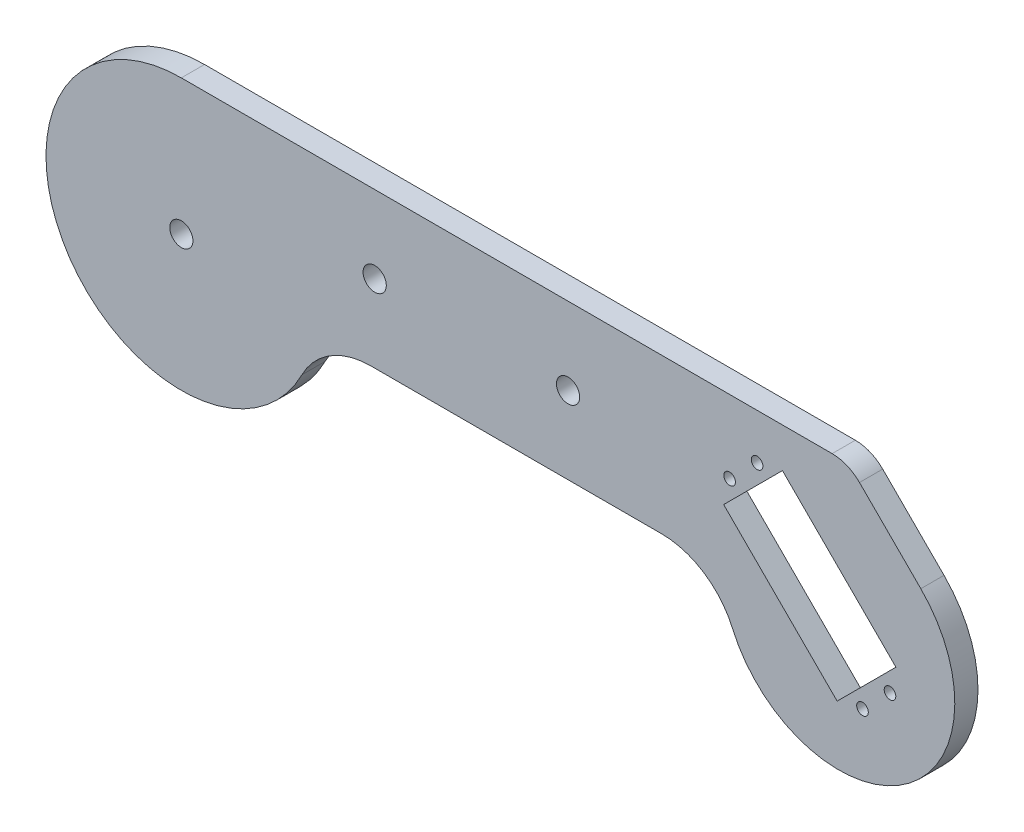
ISO-10303-21;
HEADER;
FILE_DESCRIPTION(('STEP AP214'),'2;1');
FILE_NAME('part.step','',(''),(''),'','','');
FILE_SCHEMA(('AUTOMOTIVE_DESIGN { 1 0 10303 214 1 1 1 1 }'));
ENDSEC;
DATA;
#1=APPLICATION_CONTEXT('core data for automotive mechanical design processes');
#2=APPLICATION_PROTOCOL_DEFINITION('international standard','automotive_design',2000,#1);
#3=PRODUCT_CONTEXT('',#1,'mechanical');
#4=PRODUCT('Part','Part','',(#3));
#5=PRODUCT_RELATED_PRODUCT_CATEGORY('part','',(#4));
#6=PRODUCT_DEFINITION_FORMATION('','',#4);
#7=PRODUCT_DEFINITION_CONTEXT('part definition',#1,'design');
#8=PRODUCT_DEFINITION('design','',#6,#7);
#9=PRODUCT_DEFINITION_SHAPE('','',#8);
#10=(LENGTH_UNIT() NAMED_UNIT(*) SI_UNIT(.MILLI.,.METRE.));
#11=(NAMED_UNIT(*) PLANE_ANGLE_UNIT() SI_UNIT($,.RADIAN.));
#12=(NAMED_UNIT(*) SI_UNIT($,.STERADIAN.) SOLID_ANGLE_UNIT());
#13=UNCERTAINTY_MEASURE_WITH_UNIT(LENGTH_MEASURE(1.E-05),#10,'distance_accuracy_value','');
#14=(GEOMETRIC_REPRESENTATION_CONTEXT(3) GLOBAL_UNCERTAINTY_ASSIGNED_CONTEXT((#13)) GLOBAL_UNIT_ASSIGNED_CONTEXT((#10,
#11,#12)) REPRESENTATION_CONTEXT('',''));
#15=CARTESIAN_POINT('',(0.,0.,0.));
#16=DIRECTION('',(0.,0.,1.));
#17=DIRECTION('',(1.,0.,0.));
#18=AXIS2_PLACEMENT_3D('',#15,#16,#17);
#19=CARTESIAN_POINT('',(170.,-5.,6.));
#20=DIRECTION('',(0.,0.,1.));
#21=DIRECTION('',(1.,0.,0.));
#22=AXIS2_PLACEMENT_3D('',#19,#20,#21);
#23=PLANE('',#22);
#24=CARTESIAN_POINT('',(148.875627927253,23.2307952236721,6.));
#25=DIRECTION('',(0.,0.,1.));
#26=DIRECTION('',(1.,0.,0.));
#27=AXIS2_PLACEMENT_3D('',#24,#25,#26);
#28=CIRCLE('',#27,1.5);
#29=CARTESIAN_POINT('',(150.375627927253,23.2307952236721,6.));
#30=VERTEX_POINT('',#29);
#31=EDGE_CURVE('E368',#30,#30,#28,.T.);
#32=ORIENTED_EDGE('',*,*,#31,.F.);
#33=EDGE_LOOP('',(#32));
#34=FACE_BOUND('',#33,.T.);
#35=CARTESIAN_POINT('',(183.241017492919,-11.134594341994,6.));
#36=DIRECTION('',(0.,0.,1.));
#37=DIRECTION('',(-1.,0.,0.));
#38=AXIS2_PLACEMENT_3D('',#35,#36,#37);
#39=CIRCLE('',#38,1.5);
#40=CARTESIAN_POINT('',(181.741017492919,-11.134594341994,6.));
#41=VERTEX_POINT('',#40);
#42=EDGE_CURVE('E157',#41,#41,#39,.T.);
#43=ORIENTED_EDGE('',*,*,#42,.F.);
#44=EDGE_LOOP('',(#43));
#45=FACE_BOUND('',#44,.T.);
#46=CARTESIAN_POINT('',(50.,15.,6.));
#47=DIRECTION('',(0.,0.,1.));
#48=DIRECTION('',(1.,0.,0.));
#49=AXIS2_PLACEMENT_3D('',#46,#47,#48);
#50=CIRCLE('',#49,3.00000000000001);
#51=CARTESIAN_POINT('',(53.,15.,6.));
#52=VERTEX_POINT('',#51);
#53=EDGE_CURVE('E173',#52,#52,#50,.T.);
#54=ORIENTED_EDGE('',*,*,#53,.F.);
#55=EDGE_LOOP('',(#54));
#56=FACE_BOUND('',#55,.T.);
#57=CARTESIAN_POINT('',(170.,-5.,6.));
#58=DIRECTION('',(0.,0.,1.));
#59=DIRECTION('',(1.,0.,0.));
#60=AXIS2_PLACEMENT_3D('',#57,#58,#59);
#61=CIRCLE('',#60,30.);
#62=CARTESIAN_POINT('',(142.504545830265,-17.,6.));
#63=VERTEX_POINT('',#62);
#64=CARTESIAN_POINT('',(191.213203435596,16.2132034355964,6.));
#65=VERTEX_POINT('',#64);
#66=EDGE_CURVE('E185',#63,#65,#61,.T.);
#67=ORIENTED_EDGE('',*,*,#66,.T.);
#68=DIRECTION('',(-0.707106781186547,0.707106781186548,0.));
#69=VECTOR('',#68,1.);
#70=CARTESIAN_POINT('',(175.355339059327,32.0710678118655,6.));
#71=LINE('',#70,#69);
#72=CARTESIAN_POINT('',(175.355339059327,32.0710678118655,6.));
#73=VERTEX_POINT('',#72);
#74=EDGE_CURVE('E188',#65,#73,#71,.T.);
#75=ORIENTED_EDGE('',*,*,#74,.T.);
#76=CARTESIAN_POINT('',(168.284271247462,25.,6.));
#77=DIRECTION('',(0.,0.,1.));
#78=DIRECTION('',(1.,0.,0.));
#79=AXIS2_PLACEMENT_3D('',#76,#77,#78);
#80=CIRCLE('',#79,10.);
#81=CARTESIAN_POINT('',(168.284271247462,35.,6.));
#82=VERTEX_POINT('',#81);
#83=EDGE_CURVE('E191',#73,#82,#80,.T.);
#84=ORIENTED_EDGE('',*,*,#83,.T.);
#85=DIRECTION('',(-1.,0.,0.));
#86=VECTOR('',#85,1.);
#87=CARTESIAN_POINT('',(0.,35.,6.));
#88=LINE('',#87,#86);
#89=CARTESIAN_POINT('',(0.,35.,6.));
#90=VERTEX_POINT('',#89);
#91=EDGE_CURVE('E193',#82,#90,#88,.T.);
#92=ORIENTED_EDGE('',*,*,#91,.T.);
#93=CARTESIAN_POINT('',(0.,0.,6.));
#94=DIRECTION('',(0.,0.,1.));
#95=DIRECTION('',(1.,0.,0.));
#96=AXIS2_PLACEMENT_3D('',#93,#94,#95);
#97=CIRCLE('',#96,35.);
#98=CARTESIAN_POINT('',(31.1753239990586,-15.9090909090909,6.));
#99=VERTEX_POINT('',#98);
#100=EDGE_CURVE('E195',#90,#99,#97,.T.);
#101=ORIENTED_EDGE('',*,*,#100,.T.);
#102=CARTESIAN_POINT('',(48.9897948556636,-25.,6.));
#103=DIRECTION('',(0.,0.,-1.));
#104=DIRECTION('',(1.,0.,0.));
#105=AXIS2_PLACEMENT_3D('',#102,#103,#104);
#106=CIRCLE('',#105,20.);
#107=CARTESIAN_POINT('',(48.9897948556636,-5.00000000000002,6.));
#108=VERTEX_POINT('',#107);
#109=EDGE_CURVE('E197',#99,#108,#106,.T.);
#110=ORIENTED_EDGE('',*,*,#109,.T.);
#111=DIRECTION('',(1.,0.,0.));
#112=VECTOR('',#111,1.);
#113=CARTESIAN_POINT('',(124.174243050441,-5.,6.));
#114=LINE('',#113,#112);
#115=CARTESIAN_POINT('',(124.174243050441,-5.,6.));
#116=VERTEX_POINT('',#115);
#117=EDGE_CURVE('E199',#108,#116,#114,.T.);
#118=ORIENTED_EDGE('',*,*,#117,.T.);
#119=CARTESIAN_POINT('',(124.174243050441,-25.,6.));
#120=DIRECTION('',(0.,0.,-1.));
#121=DIRECTION('',(-1.,0.,0.));
#122=AXIS2_PLACEMENT_3D('',#119,#120,#121);
#123=CIRCLE('',#122,20.);
#124=EDGE_CURVE('E201',#116,#63,#123,.T.);
#125=ORIENTED_EDGE('',*,*,#124,.T.);
#126=EDGE_LOOP('',(#67,#75,#84,#92,#101,#110,#118,#125));
#127=FACE_BOUND('',#126,.T.);
#128=CARTESIAN_POINT('',(0.,0.,6.));
#129=DIRECTION('',(0.,0.,1.));
#130=DIRECTION('',(1.,0.,0.));
#131=AXIS2_PLACEMENT_3D('',#128,#129,#130);
#132=CIRCLE('',#131,3.);
#133=CARTESIAN_POINT('',(3.,0.,6.));
#134=VERTEX_POINT('',#133);
#135=EDGE_CURVE('E179',#134,#134,#132,.T.);
#136=ORIENTED_EDGE('',*,*,#135,.F.);
#137=EDGE_LOOP('',(#136));
#138=FACE_BOUND('',#137,.T.);
#139=CARTESIAN_POINT('',(100.,15.,6.));
#140=DIRECTION('',(0.,0.,1.));
#141=DIRECTION('',(1.,0.,0.));
#142=AXIS2_PLACEMENT_3D('',#139,#140,#141);
#143=CIRCLE('',#142,2.99999999999999);
#144=CARTESIAN_POINT('',(103.,15.,6.));
#145=VERTEX_POINT('',#144);
#146=EDGE_CURVE('E167',#145,#145,#143,.T.);
#147=ORIENTED_EDGE('',*,*,#146,.F.);
#148=EDGE_LOOP('',(#147));
#149=FACE_BOUND('',#148,.T.);
#150=DIRECTION('',(-0.707106781186547,0.707106781186548,0.));
#151=VECTOR('',#150,1.);
#152=CARTESIAN_POINT('',(155.434043322758,24.768752472753,6.));
#153=LINE('',#152,#151);
#154=CARTESIAN_POINT('',(184.778974742,-4.57617894648877,6.));
#155=VERTEX_POINT('',#154);
#156=CARTESIAN_POINT('',(155.434043322758,24.768752472753,6.));
#157=VERTEX_POINT('',#156);
#158=EDGE_CURVE('E136',#155,#157,#153,.T.);
#159=ORIENTED_EDGE('',*,*,#158,.F.);
#160=DIRECTION('',(0.707106781186548,0.707106781186547,0.));
#161=VECTOR('',#160,1.);
#162=CARTESIAN_POINT('',(184.778974742,-4.57617894648877,6.));
#163=LINE('',#162,#161);
#164=CARTESIAN_POINT('',(169.576178946489,-19.7789747419995,6.));
#165=VERTEX_POINT('',#164);
#166=EDGE_CURVE('E128',#165,#155,#163,.T.);
#167=ORIENTED_EDGE('',*,*,#166,.F.);
#168=DIRECTION('',(0.707106781186548,-0.707106781186548,0.));
#169=VECTOR('',#168,1.);
#170=CARTESIAN_POINT('',(140.231247527247,9.56595667724219,6.));
#171=LINE('',#170,#169);
#172=CARTESIAN_POINT('',(140.231247527247,9.56595667724219,6.));
#173=VERTEX_POINT('',#172);
#174=EDGE_CURVE('E151',#173,#165,#171,.T.);
#175=ORIENTED_EDGE('',*,*,#174,.F.);
#176=DIRECTION('',(-0.707106781186547,-0.707106781186548,0.));
#177=VECTOR('',#176,1.);
#178=CARTESIAN_POINT('',(155.434043322758,24.768752472753,6.));
#179=LINE('',#178,#177);
#180=EDGE_CURVE('E149',#157,#173,#179,.T.);
#181=ORIENTED_EDGE('',*,*,#180,.F.);
#182=EDGE_LOOP('',(#159,#167,#175,#181));
#183=FACE_BOUND('',#182,.T.);
#184=CARTESIAN_POINT('',(141.769204776328,16.1243720727474,6.));
#185=DIRECTION('',(0.,0.,1.));
#186=DIRECTION('',(1.,0.,0.));
#187=AXIS2_PLACEMENT_3D('',#184,#185,#186);
#188=CIRCLE('',#187,1.5);
#189=CARTESIAN_POINT('',(143.269204776328,16.1243720727474,6.));
#190=VERTEX_POINT('',#189);
#191=EDGE_CURVE('E374',#190,#190,#188,.T.);
#192=ORIENTED_EDGE('',*,*,#191,.F.);
#193=EDGE_LOOP('',(#192));
#194=FACE_BOUND('',#193,.T.);
#195=CARTESIAN_POINT('',(176.134594341994,-18.2410174929189,6.));
#196=DIRECTION('',(0.,0.,1.));
#197=DIRECTION('',(-1.,0.,0.));
#198=AXIS2_PLACEMENT_3D('',#195,#196,#197);
#199=CIRCLE('',#198,1.5);
#200=CARTESIAN_POINT('',(174.634594341994,-18.2410174929189,6.));
#201=VERTEX_POINT('',#200);
#202=EDGE_CURVE('E359',#201,#201,#199,.T.);
#203=ORIENTED_EDGE('',*,*,#202,.F.);
#204=EDGE_LOOP('',(#203));
#205=FACE_BOUND('',#204,.T.);
#206=ADVANCED_FACE('F39',(#34,#45,#56,#127,#138,#149,#183,#194,#205),#23,.T.);
#207=CARTESIAN_POINT('',(170.,-5.,0.));
#208=DIRECTION('',(0.,0.,1.));
#209=DIRECTION('',(1.,0.,0.));
#210=AXIS2_PLACEMENT_3D('',#207,#208,#209);
#211=PLANE('',#210);
#212=CARTESIAN_POINT('',(100.,15.,0.));
#213=DIRECTION('',(0.,0.,1.));
#214=DIRECTION('',(1.,0.,0.));
#215=AXIS2_PLACEMENT_3D('',#212,#213,#214);
#216=CIRCLE('',#215,2.99999999999999);
#217=CARTESIAN_POINT('',(103.,15.,0.));
#218=VERTEX_POINT('',#217);
#219=EDGE_CURVE('E144',#218,#218,#216,.T.);
#220=ORIENTED_EDGE('',*,*,#219,.T.);
#221=EDGE_LOOP('',(#220));
#222=FACE_BOUND('',#221,.T.);
#223=CARTESIAN_POINT('',(50.,15.,0.));
#224=DIRECTION('',(0.,0.,1.));
#225=DIRECTION('',(1.,0.,0.));
#226=AXIS2_PLACEMENT_3D('',#223,#224,#225);
#227=CIRCLE('',#226,3.00000000000001);
#228=CARTESIAN_POINT('',(53.,15.,0.));
#229=VERTEX_POINT('',#228);
#230=EDGE_CURVE('E170',#229,#229,#227,.T.);
#231=ORIENTED_EDGE('',*,*,#230,.T.);
#232=EDGE_LOOP('',(#231));
#233=FACE_BOUND('',#232,.T.);
#234=CARTESIAN_POINT('',(0.,0.,0.));
#235=DIRECTION('',(0.,0.,1.));
#236=DIRECTION('',(1.,0.,0.));
#237=AXIS2_PLACEMENT_3D('',#234,#235,#236);
#238=CIRCLE('',#237,3.);
#239=CARTESIAN_POINT('',(3.,0.,0.));
#240=VERTEX_POINT('',#239);
#241=EDGE_CURVE('E176',#240,#240,#238,.T.);
#242=ORIENTED_EDGE('',*,*,#241,.T.);
#243=EDGE_LOOP('',(#242));
#244=FACE_BOUND('',#243,.T.);
#245=CARTESIAN_POINT('',(170.,-5.,0.));
#246=DIRECTION('',(0.,0.,1.));
#247=DIRECTION('',(1.,0.,0.));
#248=AXIS2_PLACEMENT_3D('',#245,#246,#247);
#249=CIRCLE('',#248,30.);
#250=CARTESIAN_POINT('',(142.504545830265,-17.,0.));
#251=VERTEX_POINT('',#250);
#252=CARTESIAN_POINT('',(191.213203435596,16.2132034355964,0.));
#253=VERTEX_POINT('',#252);
#254=EDGE_CURVE('E182',#251,#253,#249,.T.);
#255=ORIENTED_EDGE('',*,*,#254,.F.);
#256=CARTESIAN_POINT('',(124.174243050441,-25.,0.));
#257=DIRECTION('',(0.,0.,-1.));
#258=DIRECTION('',(-1.,0.,0.));
#259=AXIS2_PLACEMENT_3D('',#256,#257,#258);
#260=CIRCLE('',#259,20.);
#261=CARTESIAN_POINT('',(124.174243050441,-5.,0.));
#262=VERTEX_POINT('',#261);
#263=EDGE_CURVE('E189',#262,#251,#260,.T.);
#264=ORIENTED_EDGE('',*,*,#263,.F.);
#265=DIRECTION('',(1.,0.,0.));
#266=VECTOR('',#265,1.);
#267=CARTESIAN_POINT('',(124.174243050441,-5.,0.));
#268=LINE('',#267,#266);
#269=CARTESIAN_POINT('',(48.9897948556636,-5.00000000000002,0.));
#270=VERTEX_POINT('',#269);
#271=EDGE_CURVE('E216',#270,#262,#268,.T.);
#272=ORIENTED_EDGE('',*,*,#271,.F.);
#273=CARTESIAN_POINT('',(48.9897948556636,-25.,0.));
#274=DIRECTION('',(0.,0.,-1.));
#275=DIRECTION('',(1.,0.,0.));
#276=AXIS2_PLACEMENT_3D('',#273,#274,#275);
#277=CIRCLE('',#276,20.);
#278=CARTESIAN_POINT('',(31.1753239990586,-15.9090909090909,0.));
#279=VERTEX_POINT('',#278);
#280=EDGE_CURVE('E214',#279,#270,#277,.T.);
#281=ORIENTED_EDGE('',*,*,#280,.F.);
#282=CARTESIAN_POINT('',(0.,0.,0.));
#283=DIRECTION('',(0.,0.,1.));
#284=DIRECTION('',(1.,0.,0.));
#285=AXIS2_PLACEMENT_3D('',#282,#283,#284);
#286=CIRCLE('',#285,35.);
#287=CARTESIAN_POINT('',(0.,35.,0.));
#288=VERTEX_POINT('',#287);
#289=EDGE_CURVE('E212',#288,#279,#286,.T.);
#290=ORIENTED_EDGE('',*,*,#289,.F.);
#291=DIRECTION('',(-1.,0.,0.));
#292=VECTOR('',#291,1.);
#293=CARTESIAN_POINT('',(0.,35.,0.));
#294=LINE('',#293,#292);
#295=CARTESIAN_POINT('',(168.284271247462,35.,0.));
#296=VERTEX_POINT('',#295);
#297=EDGE_CURVE('E210',#296,#288,#294,.T.);
#298=ORIENTED_EDGE('',*,*,#297,.F.);
#299=CARTESIAN_POINT('',(168.284271247462,25.,0.));
#300=DIRECTION('',(0.,0.,1.));
#301=DIRECTION('',(1.,0.,0.));
#302=AXIS2_PLACEMENT_3D('',#299,#300,#301);
#303=CIRCLE('',#302,10.);
#304=CARTESIAN_POINT('',(175.355339059327,32.0710678118655,0.));
#305=VERTEX_POINT('',#304);
#306=EDGE_CURVE('E208',#305,#296,#303,.T.);
#307=ORIENTED_EDGE('',*,*,#306,.F.);
#308=DIRECTION('',(-0.707106781186547,0.707106781186548,0.));
#309=VECTOR('',#308,1.);
#310=CARTESIAN_POINT('',(175.355339059327,32.0710678118655,0.));
#311=LINE('',#310,#309);
#312=EDGE_CURVE('E206',#253,#305,#311,.T.);
#313=ORIENTED_EDGE('',*,*,#312,.F.);
#314=EDGE_LOOP('',(#255,#264,#272,#281,#290,#298,#307,#313));
#315=FACE_BOUND('',#314,.T.);
#316=DIRECTION('',(0.707106781186548,0.707106781186547,0.));
#317=VECTOR('',#316,1.);
#318=CARTESIAN_POINT('',(184.778974742,-4.57617894648877,0.));
#319=LINE('',#318,#317);
#320=CARTESIAN_POINT('',(169.576178946489,-19.7789747419995,0.));
#321=VERTEX_POINT('',#320);
#322=CARTESIAN_POINT('',(184.778974742,-4.57617894648877,0.));
#323=VERTEX_POINT('',#322);
#324=EDGE_CURVE('E62',#321,#323,#319,.T.);
#325=ORIENTED_EDGE('',*,*,#324,.T.);
#326=DIRECTION('',(-0.707106781186547,0.707106781186548,0.));
#327=VECTOR('',#326,1.);
#328=CARTESIAN_POINT('',(155.434043322758,24.768752472753,0.));
#329=LINE('',#328,#327);
#330=CARTESIAN_POINT('',(155.434043322758,24.768752472753,0.));
#331=VERTEX_POINT('',#330);
#332=EDGE_CURVE('E143',#323,#331,#329,.T.);
#333=ORIENTED_EDGE('',*,*,#332,.T.);
#334=DIRECTION('',(-0.707106781186547,-0.707106781186548,0.));
#335=VECTOR('',#334,1.);
#336=CARTESIAN_POINT('',(155.434043322758,24.768752472753,0.));
#337=LINE('',#336,#335);
#338=CARTESIAN_POINT('',(140.231247527247,9.56595667724219,0.));
#339=VERTEX_POINT('',#338);
#340=EDGE_CURVE('E159',#331,#339,#337,.T.);
#341=ORIENTED_EDGE('',*,*,#340,.T.);
#342=DIRECTION('',(0.707106781186548,-0.707106781186548,0.));
#343=VECTOR('',#342,1.);
#344=CARTESIAN_POINT('',(140.231247527247,9.56595667724219,0.));
#345=LINE('',#344,#343);
#346=EDGE_CURVE('E137',#339,#321,#345,.T.);
#347=ORIENTED_EDGE('',*,*,#346,.T.);
#348=EDGE_LOOP('',(#325,#333,#341,#347));
#349=FACE_BOUND('',#348,.T.);
#350=CARTESIAN_POINT('',(183.241017492919,-11.134594341994,0.));
#351=DIRECTION('',(0.,0.,1.));
#352=DIRECTION('',(-1.,0.,0.));
#353=AXIS2_PLACEMENT_3D('',#350,#351,#352);
#354=CIRCLE('',#353,1.5);
#355=CARTESIAN_POINT('',(181.741017492919,-11.134594341994,0.));
#356=VERTEX_POINT('',#355);
#357=EDGE_CURVE('E377',#356,#356,#354,.T.);
#358=ORIENTED_EDGE('',*,*,#357,.T.);
#359=EDGE_LOOP('',(#358));
#360=FACE_BOUND('',#359,.T.);
#361=CARTESIAN_POINT('',(141.769204776328,16.1243720727474,0.));
#362=DIRECTION('',(0.,0.,1.));
#363=DIRECTION('',(1.,0.,0.));
#364=AXIS2_PLACEMENT_3D('',#361,#362,#363);
#365=CIRCLE('',#364,1.5);
#366=CARTESIAN_POINT('',(143.269204776328,16.1243720727474,0.));
#367=VERTEX_POINT('',#366);
#368=EDGE_CURVE('E371',#367,#367,#365,.T.);
#369=ORIENTED_EDGE('',*,*,#368,.T.);
#370=EDGE_LOOP('',(#369));
#371=FACE_BOUND('',#370,.T.);
#372=CARTESIAN_POINT('',(148.875627927253,23.2307952236721,0.));
#373=DIRECTION('',(0.,0.,1.));
#374=DIRECTION('',(1.,0.,0.));
#375=AXIS2_PLACEMENT_3D('',#372,#373,#374);
#376=CIRCLE('',#375,1.5);
#377=CARTESIAN_POINT('',(150.375627927253,23.2307952236721,0.));
#378=VERTEX_POINT('',#377);
#379=EDGE_CURVE('E365',#378,#378,#376,.T.);
#380=ORIENTED_EDGE('',*,*,#379,.T.);
#381=EDGE_LOOP('',(#380));
#382=FACE_BOUND('',#381,.T.);
#383=CARTESIAN_POINT('',(176.134594341994,-18.2410174929189,0.));
#384=DIRECTION('',(0.,0.,1.));
#385=DIRECTION('',(-1.,0.,0.));
#386=AXIS2_PLACEMENT_3D('',#383,#384,#385);
#387=CIRCLE('',#386,1.5);
#388=CARTESIAN_POINT('',(174.634594341994,-18.2410174929189,0.));
#389=VERTEX_POINT('',#388);
#390=EDGE_CURVE('E362',#389,#389,#387,.T.);
#391=ORIENTED_EDGE('',*,*,#390,.T.);
#392=EDGE_LOOP('',(#391));
#393=FACE_BOUND('',#392,.T.);
#394=ADVANCED_FACE('F246',(#222,#233,#244,#315,#349,#360,#371,#382,#393),#211,.F.);
#395=CARTESIAN_POINT('',(170.,-5.,6.));
#396=DIRECTION('',(0.,0.,-1.));
#397=DIRECTION('',(-1.,0.,0.));
#398=AXIS2_PLACEMENT_3D('',#395,#396,#397);
#399=CYLINDRICAL_SURFACE('',#398,30.);
#400=ORIENTED_EDGE('',*,*,#254,.T.);
#401=DIRECTION('',(0.,0.,-1.));
#402=VECTOR('',#401,1.);
#403=CARTESIAN_POINT('',(191.213203435596,16.2132034355964,6.));
#404=LINE('',#403,#402);
#405=EDGE_CURVE('E11',#65,#253,#404,.T.);
#406=ORIENTED_EDGE('',*,*,#405,.F.);
#407=ORIENTED_EDGE('',*,*,#66,.F.);
#408=DIRECTION('',(0.,0.,-1.));
#409=VECTOR('',#408,1.);
#410=CARTESIAN_POINT('',(142.504545830265,-17.,6.));
#411=LINE('',#410,#409);
#412=EDGE_CURVE('E203',#63,#251,#411,.T.);
#413=ORIENTED_EDGE('',*,*,#412,.T.);
#414=EDGE_LOOP('',(#400,#406,#407,#413));
#415=FACE_BOUND('',#414,.T.);
#416=ADVANCED_FACE('F41',(#415),#399,.T.);
#417=CARTESIAN_POINT('',(175.355339059327,32.0710678118655,6.));
#418=DIRECTION('',(-0.707106781186548,-0.707106781186547,0.));
#419=DIRECTION('',(0.707106781186547,-0.707106781186548,0.));
#420=AXIS2_PLACEMENT_3D('',#417,#418,#419);
#421=PLANE('',#420);
#422=ORIENTED_EDGE('',*,*,#312,.T.);
#423=DIRECTION('',(0.,0.,-1.));
#424=VECTOR('',#423,1.);
#425=CARTESIAN_POINT('',(175.355339059327,32.0710678118655,6.));
#426=LINE('',#425,#424);
#427=EDGE_CURVE('E47',#73,#305,#426,.T.);
#428=ORIENTED_EDGE('',*,*,#427,.F.);
#429=ORIENTED_EDGE('',*,*,#74,.F.);
#430=ORIENTED_EDGE('',*,*,#405,.T.);
#431=EDGE_LOOP('',(#422,#428,#429,#430));
#432=FACE_BOUND('',#431,.T.);
#433=ADVANCED_FACE('F264',(#432),#421,.F.);
#434=CARTESIAN_POINT('',(168.284271247462,25.,6.));
#435=DIRECTION('',(0.,0.,-1.));
#436=DIRECTION('',(-1.,0.,0.));
#437=AXIS2_PLACEMENT_3D('',#434,#435,#436);
#438=CYLINDRICAL_SURFACE('',#437,10.);
#439=ORIENTED_EDGE('',*,*,#306,.T.);
#440=DIRECTION('',(0.,0.,-1.));
#441=VECTOR('',#440,1.);
#442=CARTESIAN_POINT('',(168.284271247462,35.,6.));
#443=LINE('',#442,#441);
#444=EDGE_CURVE('E233',#82,#296,#443,.T.);
#445=ORIENTED_EDGE('',*,*,#444,.F.);
#446=ORIENTED_EDGE('',*,*,#83,.F.);
#447=ORIENTED_EDGE('',*,*,#427,.T.);
#448=EDGE_LOOP('',(#439,#445,#446,#447));
#449=FACE_BOUND('',#448,.T.);
#450=ADVANCED_FACE('F240',(#449),#438,.T.);
#451=CARTESIAN_POINT('',(0.,35.,6.));
#452=DIRECTION('',(0.,-1.,0.));
#453=DIRECTION('',(0.,0.,-1.));
#454=AXIS2_PLACEMENT_3D('',#451,#452,#453);
#455=PLANE('',#454);
#456=ORIENTED_EDGE('',*,*,#297,.T.);
#457=DIRECTION('',(0.,0.,-1.));
#458=VECTOR('',#457,1.);
#459=CARTESIAN_POINT('',(0.,35.,6.));
#460=LINE('',#459,#458);
#461=EDGE_CURVE('E230',#90,#288,#460,.T.);
#462=ORIENTED_EDGE('',*,*,#461,.F.);
#463=ORIENTED_EDGE('',*,*,#91,.F.);
#464=ORIENTED_EDGE('',*,*,#444,.T.);
#465=EDGE_LOOP('',(#456,#462,#463,#464));
#466=FACE_BOUND('',#465,.T.);
#467=ADVANCED_FACE('F252',(#466),#455,.F.);
#468=CARTESIAN_POINT('',(0.,0.,6.));
#469=DIRECTION('',(0.,0.,-1.));
#470=DIRECTION('',(-1.,0.,0.));
#471=AXIS2_PLACEMENT_3D('',#468,#469,#470);
#472=CYLINDRICAL_SURFACE('',#471,35.);
#473=ORIENTED_EDGE('',*,*,#289,.T.);
#474=DIRECTION('',(0.,0.,-1.));
#475=VECTOR('',#474,1.);
#476=CARTESIAN_POINT('',(31.1753239990586,-15.9090909090909,6.));
#477=LINE('',#476,#475);
#478=EDGE_CURVE('E227',#99,#279,#477,.T.);
#479=ORIENTED_EDGE('',*,*,#478,.F.);
#480=ORIENTED_EDGE('',*,*,#100,.F.);
#481=ORIENTED_EDGE('',*,*,#461,.T.);
#482=EDGE_LOOP('',(#473,#479,#480,#481));
#483=FACE_BOUND('',#482,.T.);
#484=ADVANCED_FACE('F256',(#483),#472,.T.);
#485=CARTESIAN_POINT('',(48.9897948556636,-25.,6.));
#486=DIRECTION('',(0.,0.,-1.));
#487=DIRECTION('',(-1.,0.,0.));
#488=AXIS2_PLACEMENT_3D('',#485,#486,#487);
#489=CYLINDRICAL_SURFACE('',#488,20.);
#490=ORIENTED_EDGE('',*,*,#280,.T.);
#491=DIRECTION('',(0.,0.,-1.));
#492=VECTOR('',#491,1.);
#493=CARTESIAN_POINT('',(48.9897948556636,-5.00000000000002,6.));
#494=LINE('',#493,#492);
#495=EDGE_CURVE('E224',#108,#270,#494,.T.);
#496=ORIENTED_EDGE('',*,*,#495,.F.);
#497=ORIENTED_EDGE('',*,*,#109,.F.);
#498=ORIENTED_EDGE('',*,*,#478,.T.);
#499=EDGE_LOOP('',(#490,#496,#497,#498));
#500=FACE_BOUND('',#499,.T.);
#501=ADVANCED_FACE('F277',(#500),#489,.F.);
#502=CARTESIAN_POINT('',(124.174243050441,-5.,6.));
#503=DIRECTION('',(0.,1.,0.));
#504=DIRECTION('',(-1.,0.,0.));
#505=AXIS2_PLACEMENT_3D('',#502,#503,#504);
#506=PLANE('',#505);
#507=ORIENTED_EDGE('',*,*,#271,.T.);
#508=DIRECTION('',(0.,0.,-1.));
#509=VECTOR('',#508,1.);
#510=CARTESIAN_POINT('',(124.174243050441,-5.,6.));
#511=LINE('',#510,#509);
#512=EDGE_CURVE('E221',#116,#262,#511,.T.);
#513=ORIENTED_EDGE('',*,*,#512,.F.);
#514=ORIENTED_EDGE('',*,*,#117,.F.);
#515=ORIENTED_EDGE('',*,*,#495,.T.);
#516=EDGE_LOOP('',(#507,#513,#514,#515));
#517=FACE_BOUND('',#516,.T.);
#518=ADVANCED_FACE('F275',(#517),#506,.F.);
#519=CARTESIAN_POINT('',(124.174243050441,-25.,6.));
#520=DIRECTION('',(0.,0.,-1.));
#521=DIRECTION('',(-1.,0.,0.));
#522=AXIS2_PLACEMENT_3D('',#519,#520,#521);
#523=CYLINDRICAL_SURFACE('',#522,20.);
#524=ORIENTED_EDGE('',*,*,#263,.T.);
#525=ORIENTED_EDGE('',*,*,#412,.F.);
#526=ORIENTED_EDGE('',*,*,#124,.F.);
#527=ORIENTED_EDGE('',*,*,#512,.T.);
#528=EDGE_LOOP('',(#524,#525,#526,#527));
#529=FACE_BOUND('',#528,.T.);
#530=ADVANCED_FACE('F270',(#529),#523,.F.);
#531=CARTESIAN_POINT('',(0.,0.,6.));
#532=DIRECTION('',(0.,0.,-1.));
#533=DIRECTION('',(-1.,0.,0.));
#534=AXIS2_PLACEMENT_3D('',#531,#532,#533);
#535=CYLINDRICAL_SURFACE('',#534,3.);
#536=ORIENTED_EDGE('',*,*,#135,.T.);
#537=EDGE_LOOP('',(#536));
#538=FACE_BOUND('',#537,.T.);
#539=ORIENTED_EDGE('',*,*,#241,.F.);
#540=EDGE_LOOP('',(#539));
#541=FACE_BOUND('',#540,.T.);
#542=ADVANCED_FACE('F297',(#538,#541),#535,.F.);
#543=CARTESIAN_POINT('',(50.,15.,6.));
#544=DIRECTION('',(0.,0.,-1.));
#545=DIRECTION('',(-1.,0.,0.));
#546=AXIS2_PLACEMENT_3D('',#543,#544,#545);
#547=CYLINDRICAL_SURFACE('',#546,3.00000000000001);
#548=ORIENTED_EDGE('',*,*,#53,.T.);
#549=EDGE_LOOP('',(#548));
#550=FACE_BOUND('',#549,.T.);
#551=ORIENTED_EDGE('',*,*,#230,.F.);
#552=EDGE_LOOP('',(#551));
#553=FACE_BOUND('',#552,.T.);
#554=ADVANCED_FACE('F304',(#550,#553),#547,.F.);
#555=CARTESIAN_POINT('',(100.,15.,6.));
#556=DIRECTION('',(0.,0.,-1.));
#557=DIRECTION('',(-1.,0.,0.));
#558=AXIS2_PLACEMENT_3D('',#555,#556,#557);
#559=CYLINDRICAL_SURFACE('',#558,2.99999999999999);
#560=ORIENTED_EDGE('',*,*,#146,.T.);
#561=EDGE_LOOP('',(#560));
#562=FACE_BOUND('',#561,.T.);
#563=ORIENTED_EDGE('',*,*,#219,.F.);
#564=EDGE_LOOP('',(#563));
#565=FACE_BOUND('',#564,.T.);
#566=ADVANCED_FACE('F309',(#562,#565),#559,.F.);
#567=CARTESIAN_POINT('',(184.778974742,-4.57617894648877,6.));
#568=DIRECTION('',(-0.707106781186547,0.707106781186548,0.));
#569=DIRECTION('',(-0.707106781186548,-0.707106781186547,0.));
#570=AXIS2_PLACEMENT_3D('',#567,#568,#569);
#571=PLANE('',#570);
#572=ORIENTED_EDGE('',*,*,#324,.F.);
#573=DIRECTION('',(0.,0.,-1.));
#574=VECTOR('',#573,1.);
#575=CARTESIAN_POINT('',(169.576178946489,-19.7789747419995,6.));
#576=LINE('',#575,#574);
#577=EDGE_CURVE('E132',#165,#321,#576,.T.);
#578=ORIENTED_EDGE('',*,*,#577,.F.);
#579=ORIENTED_EDGE('',*,*,#166,.T.);
#580=DIRECTION('',(0.,0.,-1.));
#581=VECTOR('',#580,1.);
#582=CARTESIAN_POINT('',(184.778974742,-4.57617894648877,6.));
#583=LINE('',#582,#581);
#584=EDGE_CURVE('E131',#155,#323,#583,.T.);
#585=ORIENTED_EDGE('',*,*,#584,.T.);
#586=EDGE_LOOP('',(#572,#578,#579,#585));
#587=FACE_BOUND('',#586,.T.);
#588=ADVANCED_FACE('F130',(#587),#571,.T.);
#589=CARTESIAN_POINT('',(155.434043322758,24.768752472753,6.));
#590=DIRECTION('',(-0.707106781186548,-0.707106781186547,0.));
#591=DIRECTION('',(0.707106781186547,-0.707106781186548,0.));
#592=AXIS2_PLACEMENT_3D('',#589,#590,#591);
#593=PLANE('',#592);
#594=ORIENTED_EDGE('',*,*,#332,.F.);
#595=ORIENTED_EDGE('',*,*,#584,.F.);
#596=ORIENTED_EDGE('',*,*,#158,.T.);
#597=DIRECTION('',(0.,0.,-1.));
#598=VECTOR('',#597,1.);
#599=CARTESIAN_POINT('',(155.434043322758,24.768752472753,6.));
#600=LINE('',#599,#598);
#601=EDGE_CURVE('E145',#157,#331,#600,.T.);
#602=ORIENTED_EDGE('',*,*,#601,.T.);
#603=EDGE_LOOP('',(#594,#595,#596,#602));
#604=FACE_BOUND('',#603,.T.);
#605=ADVANCED_FACE('F140',(#604),#593,.T.);
#606=CARTESIAN_POINT('',(155.434043322758,24.768752472753,6.));
#607=DIRECTION('',(0.707106781186548,-0.707106781186547,0.));
#608=DIRECTION('',(0.707106781186547,0.707106781186548,0.));
#609=AXIS2_PLACEMENT_3D('',#606,#607,#608);
#610=PLANE('',#609);
#611=ORIENTED_EDGE('',*,*,#340,.F.);
#612=ORIENTED_EDGE('',*,*,#601,.F.);
#613=ORIENTED_EDGE('',*,*,#180,.T.);
#614=DIRECTION('',(0.,0.,-1.));
#615=VECTOR('',#614,1.);
#616=CARTESIAN_POINT('',(140.231247527247,9.56595667724219,6.));
#617=LINE('',#616,#615);
#618=EDGE_CURVE('E54',#173,#339,#617,.T.);
#619=ORIENTED_EDGE('',*,*,#618,.T.);
#620=EDGE_LOOP('',(#611,#612,#613,#619));
#621=FACE_BOUND('',#620,.T.);
#622=ADVANCED_FACE('F332',(#621),#610,.T.);
#623=CARTESIAN_POINT('',(140.231247527247,9.56595667724219,6.));
#624=DIRECTION('',(0.707106781186547,0.707106781186547,0.));
#625=DIRECTION('',(-0.707106781186548,0.707106781186548,0.));
#626=AXIS2_PLACEMENT_3D('',#623,#624,#625);
#627=PLANE('',#626);
#628=ORIENTED_EDGE('',*,*,#346,.F.);
#629=ORIENTED_EDGE('',*,*,#618,.F.);
#630=ORIENTED_EDGE('',*,*,#174,.T.);
#631=ORIENTED_EDGE('',*,*,#577,.T.);
#632=EDGE_LOOP('',(#628,#629,#630,#631));
#633=FACE_BOUND('',#632,.T.);
#634=ADVANCED_FACE('F335',(#633),#627,.T.);
#635=CARTESIAN_POINT('',(183.241017492919,-11.134594341994,6.));
#636=DIRECTION('',(0.,0.,-1.));
#637=DIRECTION('',(-1.,0.,0.));
#638=AXIS2_PLACEMENT_3D('',#635,#636,#637);
#639=CYLINDRICAL_SURFACE('',#638,1.5);
#640=ORIENTED_EDGE('',*,*,#42,.T.);
#641=EDGE_LOOP('',(#640));
#642=FACE_BOUND('',#641,.T.);
#643=ORIENTED_EDGE('',*,*,#357,.F.);
#644=EDGE_LOOP('',(#643));
#645=FACE_BOUND('',#644,.T.);
#646=ADVANCED_FACE('F339',(#642,#645),#639,.F.);
#647=CARTESIAN_POINT('',(141.769204776328,16.1243720727474,6.));
#648=DIRECTION('',(0.,0.,-1.));
#649=DIRECTION('',(-1.,0.,0.));
#650=AXIS2_PLACEMENT_3D('',#647,#648,#649);
#651=CYLINDRICAL_SURFACE('',#650,1.5);
#652=ORIENTED_EDGE('',*,*,#191,.T.);
#653=EDGE_LOOP('',(#652));
#654=FACE_BOUND('',#653,.T.);
#655=ORIENTED_EDGE('',*,*,#368,.F.);
#656=EDGE_LOOP('',(#655));
#657=FACE_BOUND('',#656,.T.);
#658=ADVANCED_FACE('F342',(#654,#657),#651,.F.);
#659=CARTESIAN_POINT('',(148.875627927253,23.2307952236721,6.));
#660=DIRECTION('',(0.,0.,-1.));
#661=DIRECTION('',(-1.,0.,0.));
#662=AXIS2_PLACEMENT_3D('',#659,#660,#661);
#663=CYLINDRICAL_SURFACE('',#662,1.5);
#664=ORIENTED_EDGE('',*,*,#31,.T.);
#665=EDGE_LOOP('',(#664));
#666=FACE_BOUND('',#665,.T.);
#667=ORIENTED_EDGE('',*,*,#379,.F.);
#668=EDGE_LOOP('',(#667));
#669=FACE_BOUND('',#668,.T.);
#670=ADVANCED_FACE('F346',(#666,#669),#663,.F.);
#671=CARTESIAN_POINT('',(176.134594341994,-18.2410174929189,6.));
#672=DIRECTION('',(0.,0.,-1.));
#673=DIRECTION('',(-1.,0.,0.));
#674=AXIS2_PLACEMENT_3D('',#671,#672,#673);
#675=CYLINDRICAL_SURFACE('',#674,1.5);
#676=ORIENTED_EDGE('',*,*,#202,.T.);
#677=EDGE_LOOP('',(#676));
#678=FACE_BOUND('',#677,.T.);
#679=ORIENTED_EDGE('',*,*,#390,.F.);
#680=EDGE_LOOP('',(#679));
#681=FACE_BOUND('',#680,.T.);
#682=ADVANCED_FACE('F350',(#678,#681),#675,.F.);
#683=CLOSED_SHELL('',(#206,#394,#416,#433,#450,#467,#484,#501,#518,#530,#542,#554,#566,#588,
#605,#622,#634,#646,#658,#670,#682));
#684=MANIFOLD_SOLID_BREP('B2',#683);
#685=ADVANCED_BREP_SHAPE_REPRESENTATION('',(#18,#684),#14);
#686=SHAPE_DEFINITION_REPRESENTATION(#9,#685);
ENDSEC;
END-ISO-10303-21;
